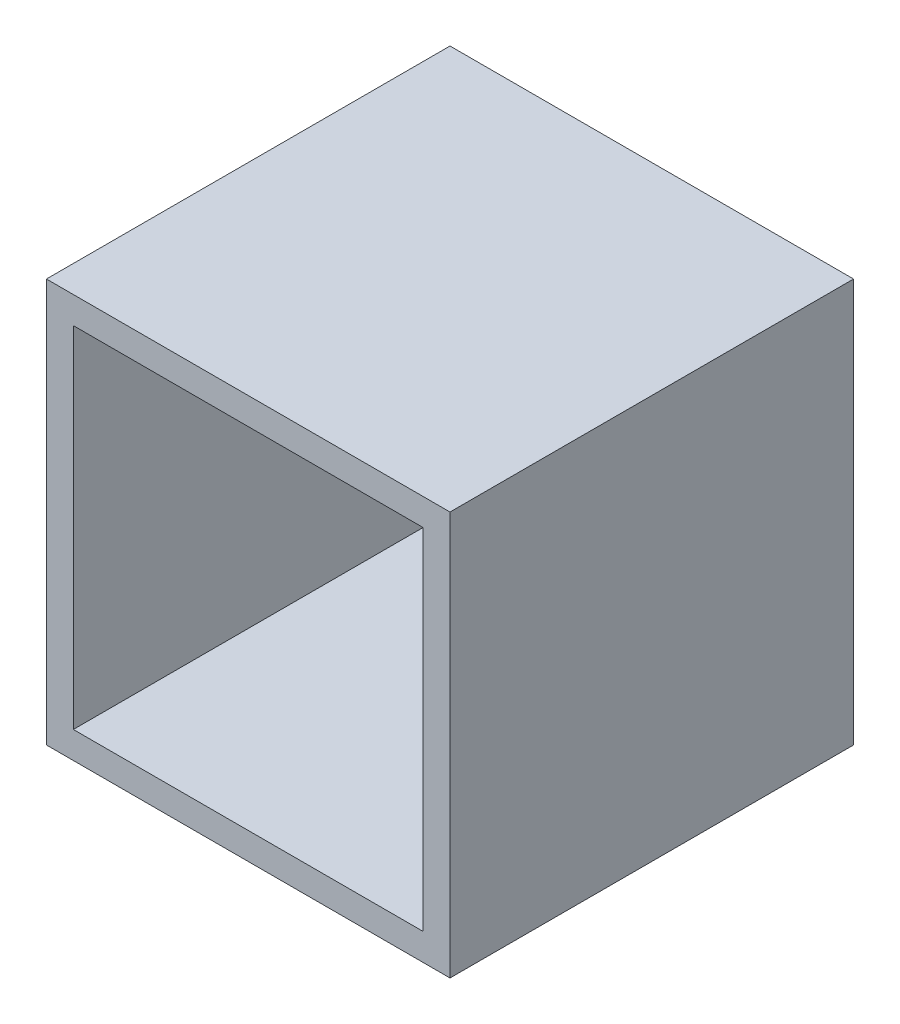
ISO-10303-21;
HEADER;
FILE_DESCRIPTION(('STEP AP214'),'2;1');
FILE_NAME('part.step','',(''),(''),'','','');
FILE_SCHEMA(('AUTOMOTIVE_DESIGN { 1 0 10303 214 1 1 1 1 }'));
ENDSEC;
DATA;
#1=APPLICATION_CONTEXT('core data for automotive mechanical design processes');
#2=APPLICATION_PROTOCOL_DEFINITION('international standard','automotive_design',2000,#1);
#3=PRODUCT_CONTEXT('',#1,'mechanical');
#4=PRODUCT('Part','Part','',(#3));
#5=PRODUCT_RELATED_PRODUCT_CATEGORY('part','',(#4));
#6=PRODUCT_DEFINITION_FORMATION('','',#4);
#7=PRODUCT_DEFINITION_CONTEXT('part definition',#1,'design');
#8=PRODUCT_DEFINITION('design','',#6,#7);
#9=PRODUCT_DEFINITION_SHAPE('','',#8);
#10=(LENGTH_UNIT() NAMED_UNIT(*) SI_UNIT(.MILLI.,.METRE.));
#11=(NAMED_UNIT(*) PLANE_ANGLE_UNIT() SI_UNIT($,.RADIAN.));
#12=(NAMED_UNIT(*) SI_UNIT($,.STERADIAN.) SOLID_ANGLE_UNIT());
#13=UNCERTAINTY_MEASURE_WITH_UNIT(LENGTH_MEASURE(1.E-05),#10,'distance_accuracy_value','');
#14=(GEOMETRIC_REPRESENTATION_CONTEXT(3) GLOBAL_UNCERTAINTY_ASSIGNED_CONTEXT((#13)) GLOBAL_UNIT_ASSIGNED_CONTEXT((#10,
#11,#12)) REPRESENTATION_CONTEXT('',''));
#15=CARTESIAN_POINT('',(0.,0.,0.));
#16=DIRECTION('',(0.,0.,1.));
#17=DIRECTION('',(1.,0.,0.));
#18=AXIS2_PLACEMENT_3D('',#15,#16,#17);
#19=CARTESIAN_POINT('',(0.,0.,30.));
#20=DIRECTION('',(0.,0.,1.));
#21=DIRECTION('',(1.,0.,0.));
#22=AXIS2_PLACEMENT_3D('',#19,#20,#21);
#23=PLANE('',#22);
#24=DIRECTION('',(0.,-1.,0.));
#25=VECTOR('',#24,1.);
#26=CARTESIAN_POINT('',(-4.62548566478165,27.5182805690849,30.));
#27=LINE('',#26,#25);
#28=CARTESIAN_POINT('',(-4.62548566478165,27.5182805690849,30.));
#29=VERTEX_POINT('',#28);
#30=CARTESIAN_POINT('',(-4.62548566478165,-2.48171943091514,30.));
#31=VERTEX_POINT('',#30);
#32=EDGE_CURVE('E169',#29,#31,#27,.T.);
#33=ORIENTED_EDGE('',*,*,#32,.T.);
#34=DIRECTION('',(1.,0.,0.));
#35=VECTOR('',#34,1.);
#36=CARTESIAN_POINT('',(-4.62548566478165,-2.48171943091514,30.));
#37=LINE('',#36,#35);
#38=CARTESIAN_POINT('',(25.3745143352184,-2.48171943091514,30.));
#39=VERTEX_POINT('',#38);
#40=EDGE_CURVE('E96',#31,#39,#37,.T.);
#41=ORIENTED_EDGE('',*,*,#40,.T.);
#42=DIRECTION('',(0.,1.,0.));
#43=VECTOR('',#42,1.);
#44=CARTESIAN_POINT('',(25.3745143352184,27.5182805690849,30.));
#45=LINE('',#44,#43);
#46=CARTESIAN_POINT('',(25.3745143352184,27.5182805690849,30.));
#47=VERTEX_POINT('',#46);
#48=EDGE_CURVE('E174',#39,#47,#45,.T.);
#49=ORIENTED_EDGE('',*,*,#48,.T.);
#50=DIRECTION('',(-1.,0.,0.));
#51=VECTOR('',#50,1.);
#52=CARTESIAN_POINT('',(-4.62548566478165,27.5182805690849,30.));
#53=LINE('',#52,#51);
#54=EDGE_CURVE('E68',#47,#29,#53,.T.);
#55=ORIENTED_EDGE('',*,*,#54,.T.);
#56=EDGE_LOOP('',(#33,#41,#49,#55));
#57=FACE_BOUND('',#56,.T.);
#58=DIRECTION('',(0.,-1.,0.));
#59=VECTOR('',#58,1.);
#60=CARTESIAN_POINT('',(-2.62548566478165,0.,30.));
#61=LINE('',#60,#59);
#62=CARTESIAN_POINT('',(-2.62548566478165,25.5182805690849,30.));
#63=VERTEX_POINT('',#62);
#64=CARTESIAN_POINT('',(-2.62548566478165,-0.481719430915135,30.));
#65=VERTEX_POINT('',#64);
#66=EDGE_CURVE('E150',#63,#65,#61,.T.);
#67=ORIENTED_EDGE('',*,*,#66,.F.);
#68=DIRECTION('',(1.,0.,0.));
#69=VECTOR('',#68,1.);
#70=CARTESIAN_POINT('',(0.,25.5182805690849,30.));
#71=LINE('',#70,#69);
#72=CARTESIAN_POINT('',(23.3745143352184,25.5182805690849,30.));
#73=VERTEX_POINT('',#72);
#74=EDGE_CURVE('E59',#63,#73,#71,.T.);
#75=ORIENTED_EDGE('',*,*,#74,.T.);
#76=DIRECTION('',(0.,-1.,0.));
#77=VECTOR('',#76,1.);
#78=CARTESIAN_POINT('',(23.3745143352184,0.,30.));
#79=LINE('',#78,#77);
#80=CARTESIAN_POINT('',(23.3745143352184,-0.481719430915135,30.));
#81=VERTEX_POINT('',#80);
#82=EDGE_CURVE('E136',#73,#81,#79,.T.);
#83=ORIENTED_EDGE('',*,*,#82,.T.);
#84=DIRECTION('',(1.,0.,0.));
#85=VECTOR('',#84,1.);
#86=CARTESIAN_POINT('',(0.,-0.481719430915135,30.));
#87=LINE('',#86,#85);
#88=EDGE_CURVE('E153',#65,#81,#87,.T.);
#89=ORIENTED_EDGE('',*,*,#88,.F.);
#90=EDGE_LOOP('',(#67,#75,#83,#89));
#91=FACE_BOUND('',#90,.T.);
#92=ADVANCED_FACE('F43',(#57,#91),#23,.T.);
#93=CARTESIAN_POINT('',(-4.62548566478165,27.5182805690849,30.));
#94=DIRECTION('',(1.,0.,0.));
#95=DIRECTION('',(0.,1.,0.));
#96=AXIS2_PLACEMENT_3D('',#93,#94,#95);
#97=PLANE('',#96);
#98=DIRECTION('',(0.,-1.,0.));
#99=VECTOR('',#98,1.);
#100=CARTESIAN_POINT('',(-4.62548566478165,27.5182805690849,0.));
#101=LINE('',#100,#99);
#102=CARTESIAN_POINT('',(-4.62548566478165,27.5182805690849,0.));
#103=VERTEX_POINT('',#102);
#104=CARTESIAN_POINT('',(-4.62548566478165,-2.48171943091514,0.));
#105=VERTEX_POINT('',#104);
#106=EDGE_CURVE('E163',#103,#105,#101,.T.);
#107=ORIENTED_EDGE('',*,*,#106,.T.);
#108=DIRECTION('',(0.,0.,-1.));
#109=VECTOR('',#108,1.);
#110=CARTESIAN_POINT('',(-4.62548566478165,-2.48171943091514,30.));
#111=LINE('',#110,#109);
#112=EDGE_CURVE('E11',#31,#105,#111,.T.);
#113=ORIENTED_EDGE('',*,*,#112,.F.);
#114=ORIENTED_EDGE('',*,*,#32,.F.);
#115=DIRECTION('',(0.,0.,-1.));
#116=VECTOR('',#115,1.);
#117=CARTESIAN_POINT('',(-4.62548566478165,27.5182805690849,30.));
#118=LINE('',#117,#116);
#119=EDGE_CURVE('E179',#29,#103,#118,.T.);
#120=ORIENTED_EDGE('',*,*,#119,.T.);
#121=EDGE_LOOP('',(#107,#113,#114,#120));
#122=FACE_BOUND('',#121,.T.);
#123=ADVANCED_FACE('F45',(#122),#97,.F.);
#124=CARTESIAN_POINT('',(-4.62548566478165,-2.48171943091514,30.));
#125=DIRECTION('',(0.,1.,0.));
#126=DIRECTION('',(0.,0.,1.));
#127=AXIS2_PLACEMENT_3D('',#124,#125,#126);
#128=PLANE('',#127);
#129=DIRECTION('',(1.,0.,0.));
#130=VECTOR('',#129,1.);
#131=CARTESIAN_POINT('',(-4.62548566478165,-2.48171943091514,0.));
#132=LINE('',#131,#130);
#133=CARTESIAN_POINT('',(25.3745143352184,-2.48171943091514,0.));
#134=VERTEX_POINT('',#133);
#135=EDGE_CURVE('E183',#105,#134,#132,.T.);
#136=ORIENTED_EDGE('',*,*,#135,.T.);
#137=DIRECTION('',(0.,0.,-1.));
#138=VECTOR('',#137,1.);
#139=CARTESIAN_POINT('',(25.3745143352184,-2.48171943091514,30.));
#140=LINE('',#139,#138);
#141=EDGE_CURVE('E52',#39,#134,#140,.T.);
#142=ORIENTED_EDGE('',*,*,#141,.F.);
#143=ORIENTED_EDGE('',*,*,#40,.F.);
#144=ORIENTED_EDGE('',*,*,#112,.T.);
#145=EDGE_LOOP('',(#136,#142,#143,#144));
#146=FACE_BOUND('',#145,.T.);
#147=ADVANCED_FACE('F216',(#146),#128,.F.);
#148=CARTESIAN_POINT('',(25.3745143352184,27.5182805690849,30.));
#149=DIRECTION('',(-1.,0.,0.));
#150=DIRECTION('',(0.,0.,1.));
#151=AXIS2_PLACEMENT_3D('',#148,#149,#150);
#152=PLANE('',#151);
#153=DIRECTION('',(0.,1.,0.));
#154=VECTOR('',#153,1.);
#155=CARTESIAN_POINT('',(25.3745143352184,27.5182805690849,0.));
#156=LINE('',#155,#154);
#157=CARTESIAN_POINT('',(25.3745143352184,27.5182805690849,0.));
#158=VERTEX_POINT('',#157);
#159=EDGE_CURVE('E186',#134,#158,#156,.T.);
#160=ORIENTED_EDGE('',*,*,#159,.T.);
#161=DIRECTION('',(0.,0.,-1.));
#162=VECTOR('',#161,1.);
#163=CARTESIAN_POINT('',(25.3745143352184,27.5182805690849,30.));
#164=LINE('',#163,#162);
#165=EDGE_CURVE('E193',#47,#158,#164,.T.);
#166=ORIENTED_EDGE('',*,*,#165,.F.);
#167=ORIENTED_EDGE('',*,*,#48,.F.);
#168=ORIENTED_EDGE('',*,*,#141,.T.);
#169=EDGE_LOOP('',(#160,#166,#167,#168));
#170=FACE_BOUND('',#169,.T.);
#171=ADVANCED_FACE('F200',(#170),#152,.F.);
#172=CARTESIAN_POINT('',(-4.62548566478165,27.5182805690849,30.));
#173=DIRECTION('',(0.,-1.,0.));
#174=DIRECTION('',(1.,0.,0.));
#175=AXIS2_PLACEMENT_3D('',#172,#173,#174);
#176=PLANE('',#175);
#177=DIRECTION('',(-1.,0.,0.));
#178=VECTOR('',#177,1.);
#179=CARTESIAN_POINT('',(-4.62548566478165,27.5182805690849,0.));
#180=LINE('',#179,#178);
#181=EDGE_CURVE('E89',#158,#103,#180,.T.);
#182=ORIENTED_EDGE('',*,*,#181,.T.);
#183=ORIENTED_EDGE('',*,*,#119,.F.);
#184=ORIENTED_EDGE('',*,*,#54,.F.);
#185=ORIENTED_EDGE('',*,*,#165,.T.);
#186=EDGE_LOOP('',(#182,#183,#184,#185));
#187=FACE_BOUND('',#186,.T.);
#188=ADVANCED_FACE('F208',(#187),#176,.F.);
#189=CARTESIAN_POINT('',(0.,0.,0.));
#190=DIRECTION('',(0.,0.,1.));
#191=DIRECTION('',(1.,0.,0.));
#192=AXIS2_PLACEMENT_3D('',#189,#190,#191);
#193=PLANE('',#192);
#194=ORIENTED_EDGE('',*,*,#106,.F.);
#195=ORIENTED_EDGE('',*,*,#181,.F.);
#196=ORIENTED_EDGE('',*,*,#159,.F.);
#197=ORIENTED_EDGE('',*,*,#135,.F.);
#198=EDGE_LOOP('',(#194,#195,#196,#197));
#199=FACE_BOUND('',#198,.T.);
#200=ADVANCED_FACE('F204',(#199),#193,.F.);
#201=CARTESIAN_POINT('',(0.,25.5182805690849,2.));
#202=DIRECTION('',(0.,-1.,0.));
#203=DIRECTION('',(0.,0.,-1.));
#204=AXIS2_PLACEMENT_3D('',#201,#202,#203);
#205=PLANE('',#204);
#206=ORIENTED_EDGE('',*,*,#74,.F.);
#207=DIRECTION('',(0.,0.,1.));
#208=VECTOR('',#207,1.);
#209=CARTESIAN_POINT('',(-2.62548566478165,25.5182805690849,2.));
#210=LINE('',#209,#208);
#211=CARTESIAN_POINT('',(-2.62548566478165,25.5182805690849,2.));
#212=VERTEX_POINT('',#211);
#213=EDGE_CURVE('E117',#212,#63,#210,.T.);
#214=ORIENTED_EDGE('',*,*,#213,.F.);
#215=DIRECTION('',(1.,0.,0.));
#216=VECTOR('',#215,1.);
#217=CARTESIAN_POINT('',(0.,25.5182805690849,2.));
#218=LINE('',#217,#216);
#219=CARTESIAN_POINT('',(23.3745143352184,25.5182805690849,2.));
#220=VERTEX_POINT('',#219);
#221=EDGE_CURVE('E120',#212,#220,#218,.T.);
#222=ORIENTED_EDGE('',*,*,#221,.T.);
#223=DIRECTION('',(0.,0.,1.));
#224=VECTOR('',#223,1.);
#225=CARTESIAN_POINT('',(23.3745143352184,25.5182805690849,2.));
#226=LINE('',#225,#224);
#227=EDGE_CURVE('E160',#220,#73,#226,.T.);
#228=ORIENTED_EDGE('',*,*,#227,.T.);
#229=EDGE_LOOP('',(#206,#214,#222,#228));
#230=FACE_BOUND('',#229,.T.);
#231=ADVANCED_FACE('F119',(#230),#205,.T.);
#232=CARTESIAN_POINT('',(23.3745143352184,0.,2.));
#233=DIRECTION('',(-1.,0.,0.));
#234=DIRECTION('',(0.,-1.,0.));
#235=AXIS2_PLACEMENT_3D('',#232,#233,#234);
#236=PLANE('',#235);
#237=ORIENTED_EDGE('',*,*,#82,.F.);
#238=ORIENTED_EDGE('',*,*,#227,.F.);
#239=DIRECTION('',(0.,-1.,0.));
#240=VECTOR('',#239,1.);
#241=CARTESIAN_POINT('',(23.3745143352184,0.,2.));
#242=LINE('',#241,#240);
#243=CARTESIAN_POINT('',(23.3745143352184,-0.481719430915135,2.));
#244=VERTEX_POINT('',#243);
#245=EDGE_CURVE('E128',#220,#244,#242,.T.);
#246=ORIENTED_EDGE('',*,*,#245,.T.);
#247=DIRECTION('',(0.,0.,1.));
#248=VECTOR('',#247,1.);
#249=CARTESIAN_POINT('',(23.3745143352184,-0.481719430915135,2.));
#250=LINE('',#249,#248);
#251=EDGE_CURVE('E164',#244,#81,#250,.T.);
#252=ORIENTED_EDGE('',*,*,#251,.T.);
#253=EDGE_LOOP('',(#237,#238,#246,#252));
#254=FACE_BOUND('',#253,.T.);
#255=ADVANCED_FACE('F227',(#254),#236,.T.);
#256=CARTESIAN_POINT('',(0.,-0.481719430915135,2.));
#257=DIRECTION('',(0.,-1.,0.));
#258=DIRECTION('',(1.,0.,0.));
#259=AXIS2_PLACEMENT_3D('',#256,#257,#258);
#260=PLANE('',#259);
#261=ORIENTED_EDGE('',*,*,#88,.T.);
#262=ORIENTED_EDGE('',*,*,#251,.F.);
#263=DIRECTION('',(1.,0.,0.));
#264=VECTOR('',#263,1.);
#265=CARTESIAN_POINT('',(0.,-0.481719430915135,2.));
#266=LINE('',#265,#264);
#267=CARTESIAN_POINT('',(-2.62548566478165,-0.481719430915135,2.));
#268=VERTEX_POINT('',#267);
#269=EDGE_CURVE('E141',#268,#244,#266,.T.);
#270=ORIENTED_EDGE('',*,*,#269,.F.);
#271=DIRECTION('',(0.,0.,1.));
#272=VECTOR('',#271,1.);
#273=CARTESIAN_POINT('',(-2.62548566478165,-0.481719430915135,2.));
#274=LINE('',#273,#272);
#275=EDGE_CURVE('E127',#268,#65,#274,.T.);
#276=ORIENTED_EDGE('',*,*,#275,.T.);
#277=EDGE_LOOP('',(#261,#262,#270,#276));
#278=FACE_BOUND('',#277,.T.);
#279=ADVANCED_FACE('F230',(#278),#260,.F.);
#280=CARTESIAN_POINT('',(-2.62548566478165,0.,2.));
#281=DIRECTION('',(-1.,0.,0.));
#282=DIRECTION('',(0.,-1.,0.));
#283=AXIS2_PLACEMENT_3D('',#280,#281,#282);
#284=PLANE('',#283);
#285=ORIENTED_EDGE('',*,*,#66,.T.);
#286=ORIENTED_EDGE('',*,*,#275,.F.);
#287=DIRECTION('',(0.,-1.,0.));
#288=VECTOR('',#287,1.);
#289=CARTESIAN_POINT('',(-2.62548566478165,0.,2.));
#290=LINE('',#289,#288);
#291=EDGE_CURVE('E134',#212,#268,#290,.T.);
#292=ORIENTED_EDGE('',*,*,#291,.F.);
#293=ORIENTED_EDGE('',*,*,#213,.T.);
#294=EDGE_LOOP('',(#285,#286,#292,#293));
#295=FACE_BOUND('',#294,.T.);
#296=ADVANCED_FACE('F138',(#295),#284,.F.);
#297=CARTESIAN_POINT('',(0.,0.,2.));
#298=DIRECTION('',(0.,0.,1.));
#299=DIRECTION('',(1.,0.,0.));
#300=AXIS2_PLACEMENT_3D('',#297,#298,#299);
#301=PLANE('',#300);
#302=ORIENTED_EDGE('',*,*,#221,.F.);
#303=ORIENTED_EDGE('',*,*,#291,.T.);
#304=ORIENTED_EDGE('',*,*,#269,.T.);
#305=ORIENTED_EDGE('',*,*,#245,.F.);
#306=EDGE_LOOP('',(#302,#303,#304,#305));
#307=FACE_BOUND('',#306,.T.);
#308=ADVANCED_FACE('F132',(#307),#301,.T.);
#309=CLOSED_SHELL('',(#92,#123,#147,#171,#188,#200,#231,#255,#279,#296,#308));
#310=MANIFOLD_SOLID_BREP('B2',#309);
#311=ADVANCED_BREP_SHAPE_REPRESENTATION('',(#18,#310),#14);
#312=SHAPE_DEFINITION_REPRESENTATION(#9,#311);
ENDSEC;
END-ISO-10303-21;
